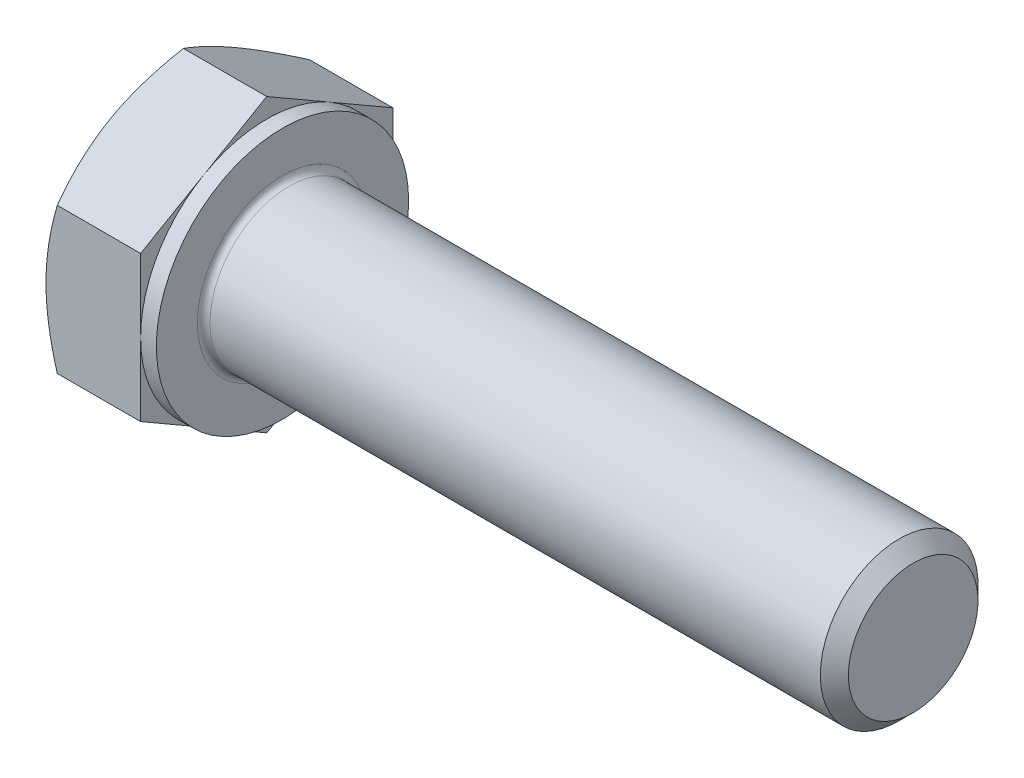
ISO-10303-21;
HEADER;
FILE_DESCRIPTION(('STEP AP214'),'2;1');
FILE_NAME('part.step','',(''),(''),'','','');
FILE_SCHEMA(('AUTOMOTIVE_DESIGN { 1 0 10303 214 1 1 1 1 }'));
ENDSEC;
DATA;
#1=APPLICATION_CONTEXT('core data for automotive mechanical design processes');
#2=APPLICATION_PROTOCOL_DEFINITION('international standard','automotive_design',2000,#1);
#3=PRODUCT_CONTEXT('',#1,'mechanical');
#4=PRODUCT('Part','Part','',(#3));
#5=PRODUCT_RELATED_PRODUCT_CATEGORY('part','',(#4));
#6=PRODUCT_DEFINITION_FORMATION('','',#4);
#7=PRODUCT_DEFINITION_CONTEXT('part definition',#1,'design');
#8=PRODUCT_DEFINITION('design','',#6,#7);
#9=PRODUCT_DEFINITION_SHAPE('','',#8);
#10=(LENGTH_UNIT() NAMED_UNIT(*) SI_UNIT(.MILLI.,.METRE.));
#11=(NAMED_UNIT(*) PLANE_ANGLE_UNIT() SI_UNIT($,.RADIAN.));
#12=(NAMED_UNIT(*) SI_UNIT($,.STERADIAN.) SOLID_ANGLE_UNIT());
#13=UNCERTAINTY_MEASURE_WITH_UNIT(LENGTH_MEASURE(1.E-05),#10,'distance_accuracy_value','');
#14=(GEOMETRIC_REPRESENTATION_CONTEXT(3) GLOBAL_UNCERTAINTY_ASSIGNED_CONTEXT((#13)) GLOBAL_UNIT_ASSIGNED_CONTEXT((#10,
#11,#12)) REPRESENTATION_CONTEXT('',''));
#15=CARTESIAN_POINT('',(0.,0.,0.));
#16=DIRECTION('',(0.,0.,1.));
#17=DIRECTION('',(1.,0.,0.));
#18=AXIS2_PLACEMENT_3D('',#15,#16,#17);
#19=CARTESIAN_POINT('',(3.5,4.61880215351701,0.));
#20=DIRECTION('',(1.,0.,0.));
#21=DIRECTION('',(0.,0.,-1.));
#22=AXIS2_PLACEMENT_3D('',#19,#20,#21);
#23=PLANE('',#22);
#24=CARTESIAN_POINT('',(3.5,0.,0.));
#25=DIRECTION('',(1.,0.,0.));
#26=DIRECTION('',(0.,0.,-1.));
#27=AXIS2_PLACEMENT_3D('',#24,#25,#26);
#28=CIRCLE('',#27,2.7);
#29=CARTESIAN_POINT('',(3.5,0.,-2.7));
#30=VERTEX_POINT('',#29);
#31=EDGE_CURVE('E44',#30,#30,#28,.F.);
#32=ORIENTED_EDGE('',*,*,#31,.T.);
#33=EDGE_LOOP('',(#32));
#34=FACE_BOUND('',#33,.T.);
#35=CARTESIAN_POINT('',(3.5,0.,0.));
#36=DIRECTION('',(1.,0.,0.));
#37=DIRECTION('',(0.,0.,-1.));
#38=AXIS2_PLACEMENT_3D('',#35,#36,#37);
#39=CIRCLE('',#38,4.);
#40=CARTESIAN_POINT('',(3.5,0.,-4.));
#41=VERTEX_POINT('',#40);
#42=EDGE_CURVE('E295',#41,#41,#39,.T.);
#43=ORIENTED_EDGE('',*,*,#42,.T.);
#44=EDGE_LOOP('',(#43));
#45=FACE_BOUND('',#44,.T.);
#46=ADVANCED_FACE('F36',(#34,#45),#23,.T.);
#47=CARTESIAN_POINT('',(0.,0.,0.));
#48=DIRECTION('',(-1.,0.,0.));
#49=DIRECTION('',(0.,0.,1.));
#50=AXIS2_PLACEMENT_3D('',#47,#48,#49);
#51=CYLINDRICAL_SURFACE('',#50,2.5);
#52=CARTESIAN_POINT('',(3.7,0.,0.));
#53=DIRECTION('',(1.,0.,0.));
#54=DIRECTION('',(0.,0.,-1.));
#55=AXIS2_PLACEMENT_3D('',#52,#53,#54);
#56=CIRCLE('',#55,2.5);
#57=CARTESIAN_POINT('',(3.7,0.,-2.5));
#58=VERTEX_POINT('',#57);
#59=EDGE_CURVE('E11',#58,#58,#56,.T.);
#60=ORIENTED_EDGE('',*,*,#59,.T.);
#61=EDGE_LOOP('',(#60));
#62=FACE_BOUND('',#61,.T.);
#63=CARTESIAN_POINT('',(23.055,0.,0.));
#64=DIRECTION('',(-1.,0.,0.));
#65=DIRECTION('',(0.,0.,1.));
#66=AXIS2_PLACEMENT_3D('',#63,#64,#65);
#67=CIRCLE('',#66,2.5);
#68=CARTESIAN_POINT('',(23.055,0.,2.5));
#69=VERTEX_POINT('',#68);
#70=EDGE_CURVE('E274',#69,#69,#67,.T.);
#71=ORIENTED_EDGE('',*,*,#70,.T.);
#72=EDGE_LOOP('',(#71));
#73=FACE_BOUND('',#72,.T.);
#74=ADVANCED_FACE('F248',(#62,#73),#51,.T.);
#75=CARTESIAN_POINT('',(23.5,0.,0.));
#76=DIRECTION('',(-1.,0.,0.));
#77=DIRECTION('',(0.,0.,1.));
#78=AXIS2_PLACEMENT_3D('',#75,#76,#77);
#79=CONICAL_SURFACE('',#78,2.055,0.785398163397439);
#80=ORIENTED_EDGE('',*,*,#70,.F.);
#81=EDGE_LOOP('',(#80));
#82=FACE_BOUND('',#81,.T.);
#83=CARTESIAN_POINT('',(23.5,0.,0.));
#84=DIRECTION('',(-1.,0.,0.));
#85=DIRECTION('',(0.,0.,1.));
#86=AXIS2_PLACEMENT_3D('',#83,#84,#85);
#87=CIRCLE('',#86,2.055);
#88=CARTESIAN_POINT('',(23.5,0.,2.055));
#89=VERTEX_POINT('',#88);
#90=EDGE_CURVE('E272',#89,#89,#87,.T.);
#91=ORIENTED_EDGE('',*,*,#90,.T.);
#92=EDGE_LOOP('',(#91));
#93=FACE_BOUND('',#92,.T.);
#94=ADVANCED_FACE('F253',(#82,#93),#79,.T.);
#95=CARTESIAN_POINT('',(23.5,0.,0.));
#96=DIRECTION('',(-1.,0.,0.));
#97=DIRECTION('',(0.,0.,1.));
#98=AXIS2_PLACEMENT_3D('',#95,#96,#97);
#99=PLANE('',#98);
#100=ORIENTED_EDGE('',*,*,#90,.F.);
#101=EDGE_LOOP('',(#100));
#102=FACE_BOUND('',#101,.T.);
#103=ADVANCED_FACE('F260',(#102),#99,.F.);
#104=CARTESIAN_POINT('',(3.,4.,0.));
#105=DIRECTION('',(1.,0.,0.));
#106=DIRECTION('',(0.,0.,-1.));
#107=AXIS2_PLACEMENT_3D('',#104,#105,#106);
#108=PLANE('',#107);
#109=DIRECTION('',(0.,0.500000000000001,0.866025403784438));
#110=VECTOR('',#109,1.);
#111=CARTESIAN_POINT('',(3.,2.3094010767585,-4.));
#112=LINE('',#111,#110);
#113=CARTESIAN_POINT('',(3.,2.3094010767585,-4.));
#114=VERTEX_POINT('',#113);
#115=CARTESIAN_POINT('',(3.,3.46410161513775,-2.));
#116=VERTEX_POINT('',#115);
#117=EDGE_CURVE('E168',#114,#116,#112,.T.);
#118=ORIENTED_EDGE('',*,*,#117,.T.);
#119=CARTESIAN_POINT('',(3.,0.,0.));
#120=DIRECTION('',(-1.,0.,0.));
#121=DIRECTION('',(0.,0.,1.));
#122=AXIS2_PLACEMENT_3D('',#119,#120,#121);
#123=CIRCLE('',#122,4.);
#124=CARTESIAN_POINT('',(3.,0.,-4.));
#125=VERTEX_POINT('',#124);
#126=EDGE_CURVE('E51',#116,#125,#123,.T.);
#127=ORIENTED_EDGE('',*,*,#126,.T.);
#128=DIRECTION('',(0.,1.,0.));
#129=VECTOR('',#128,1.);
#130=CARTESIAN_POINT('',(3.,2.3094010767585,-4.));
#131=LINE('',#130,#129);
#132=EDGE_CURVE('E298',#125,#114,#131,.T.);
#133=ORIENTED_EDGE('',*,*,#132,.T.);
#134=EDGE_LOOP('',(#118,#127,#133));
#135=FACE_BOUND('',#134,.T.);
#136=ADVANCED_FACE('F263',(#135),#108,.T.);
#137=CARTESIAN_POINT('',(3.,4.61880215351701,0.));
#138=VERTEX_POINT('',#137);
#139=EDGE_CURVE('E166',#116,#138,#112,.T.);
#140=ORIENTED_EDGE('',*,*,#139,.T.);
#141=DIRECTION('',(0.,-0.500000000000001,0.866025403784438));
#142=VECTOR('',#141,1.);
#143=CARTESIAN_POINT('',(3.,4.61880215351701,0.));
#144=LINE('',#143,#142);
#145=CARTESIAN_POINT('',(3.,3.46410161513775,2.));
#146=VERTEX_POINT('',#145);
#147=EDGE_CURVE('E165',#138,#146,#144,.T.);
#148=ORIENTED_EDGE('',*,*,#147,.T.);
#149=EDGE_CURVE('E154',#146,#116,#123,.T.);
#150=ORIENTED_EDGE('',*,*,#149,.T.);
#151=EDGE_LOOP('',(#140,#148,#150));
#152=FACE_BOUND('',#151,.T.);
#153=ADVANCED_FACE('F268',(#152),#108,.T.);
#154=CARTESIAN_POINT('',(3.,2.3094010767585,4.));
#155=VERTEX_POINT('',#154);
#156=EDGE_CURVE('E133',#146,#155,#144,.T.);
#157=ORIENTED_EDGE('',*,*,#156,.T.);
#158=DIRECTION('',(0.,-1.,0.));
#159=VECTOR('',#158,1.);
#160=CARTESIAN_POINT('',(3.,2.3094010767585,4.));
#161=LINE('',#160,#159);
#162=CARTESIAN_POINT('',(3.,0.,4.));
#163=VERTEX_POINT('',#162);
#164=EDGE_CURVE('E127',#155,#163,#161,.T.);
#165=ORIENTED_EDGE('',*,*,#164,.T.);
#166=EDGE_CURVE('E131',#163,#146,#123,.T.);
#167=ORIENTED_EDGE('',*,*,#166,.T.);
#168=EDGE_LOOP('',(#157,#165,#167));
#169=FACE_BOUND('',#168,.T.);
#170=ADVANCED_FACE('F129',(#169),#108,.T.);
#171=CARTESIAN_POINT('',(3.,-2.3094010767585,4.));
#172=VERTEX_POINT('',#171);
#173=EDGE_CURVE('E137',#163,#172,#161,.T.);
#174=ORIENTED_EDGE('',*,*,#173,.T.);
#175=DIRECTION('',(0.,-0.500000000000001,-0.866025403784438));
#176=VECTOR('',#175,1.);
#177=CARTESIAN_POINT('',(3.,-4.61880215351701,0.));
#178=LINE('',#177,#176);
#179=CARTESIAN_POINT('',(3.,-3.46410161513775,2.));
#180=VERTEX_POINT('',#179);
#181=EDGE_CURVE('E144',#172,#180,#178,.T.);
#182=ORIENTED_EDGE('',*,*,#181,.T.);
#183=EDGE_CURVE('E141',#180,#163,#123,.T.);
#184=ORIENTED_EDGE('',*,*,#183,.T.);
#185=EDGE_LOOP('',(#174,#182,#184));
#186=FACE_BOUND('',#185,.T.);
#187=ADVANCED_FACE('F142',(#186),#108,.T.);
#188=CARTESIAN_POINT('',(3.,-4.61880215351701,0.));
#189=VERTEX_POINT('',#188);
#190=EDGE_CURVE('E160',#180,#189,#178,.T.);
#191=ORIENTED_EDGE('',*,*,#190,.T.);
#192=DIRECTION('',(0.,0.5,-0.866025403784438));
#193=VECTOR('',#192,1.);
#194=CARTESIAN_POINT('',(3.,-2.30940107675851,-4.));
#195=LINE('',#194,#193);
#196=CARTESIAN_POINT('',(3.,-3.46410161513775,-2.));
#197=VERTEX_POINT('',#196);
#198=EDGE_CURVE('E336',#189,#197,#195,.T.);
#199=ORIENTED_EDGE('',*,*,#198,.T.);
#200=EDGE_CURVE('E148',#197,#180,#123,.T.);
#201=ORIENTED_EDGE('',*,*,#200,.T.);
#202=EDGE_LOOP('',(#191,#199,#201));
#203=FACE_BOUND('',#202,.T.);
#204=ADVANCED_FACE('F337',(#203),#108,.T.);
#205=CARTESIAN_POINT('',(3.,-2.30940107675851,-4.));
#206=VERTEX_POINT('',#205);
#207=EDGE_CURVE('E155',#197,#206,#195,.T.);
#208=ORIENTED_EDGE('',*,*,#207,.T.);
#209=EDGE_CURVE('E299',#206,#125,#131,.T.);
#210=ORIENTED_EDGE('',*,*,#209,.T.);
#211=EDGE_CURVE('E306',#125,#197,#123,.T.);
#212=ORIENTED_EDGE('',*,*,#211,.T.);
#213=EDGE_LOOP('',(#208,#210,#212));
#214=FACE_BOUND('',#213,.T.);
#215=ADVANCED_FACE('F269',(#214),#108,.T.);
#216=CARTESIAN_POINT('',(0.,0.,0.));
#217=DIRECTION('',(-1.,0.,0.));
#218=DIRECTION('',(0.,0.,1.));
#219=AXIS2_PLACEMENT_3D('',#216,#217,#218);
#220=CYLINDRICAL_SURFACE('',#219,4.);
#221=ORIENTED_EDGE('',*,*,#126,.F.);
#222=ORIENTED_EDGE('',*,*,#149,.F.);
#223=ORIENTED_EDGE('',*,*,#166,.F.);
#224=ORIENTED_EDGE('',*,*,#183,.F.);
#225=ORIENTED_EDGE('',*,*,#200,.F.);
#226=ORIENTED_EDGE('',*,*,#211,.F.);
#227=EDGE_LOOP('',(#221,#222,#223,#224,#225,#226));
#228=FACE_BOUND('',#227,.T.);
#229=ORIENTED_EDGE('',*,*,#42,.F.);
#230=EDGE_LOOP('',(#229));
#231=FACE_BOUND('',#230,.T.);
#232=ADVANCED_FACE('F151',(#228,#231),#220,.T.);
#233=CARTESIAN_POINT('',(0.,4.61880215351701,0.));
#234=DIRECTION('',(1.,0.,0.));
#235=DIRECTION('',(0.,0.,-1.));
#236=AXIS2_PLACEMENT_3D('',#233,#234,#235);
#237=PLANE('',#236);
#238=CARTESIAN_POINT('',(0.,0.,0.));
#239=DIRECTION('',(1.,0.,0.));
#240=DIRECTION('',(0.,0.,-1.));
#241=AXIS2_PLACEMENT_3D('',#238,#239,#240);
#242=CIRCLE('',#241,4.);
#243=CARTESIAN_POINT('',(0.,0.,-4.));
#244=VERTEX_POINT('',#243);
#245=CARTESIAN_POINT('',(0.,3.46410161513775,-2.));
#246=VERTEX_POINT('',#245);
#247=EDGE_CURVE('E294',#244,#246,#242,.T.);
#248=ORIENTED_EDGE('',*,*,#247,.F.);
#249=CARTESIAN_POINT('',(0.,-3.46410161513775,-2.));
#250=VERTEX_POINT('',#249);
#251=EDGE_CURVE('E290',#250,#244,#242,.T.);
#252=ORIENTED_EDGE('',*,*,#251,.F.);
#253=CARTESIAN_POINT('',(0.,-3.46410161513775,2.));
#254=VERTEX_POINT('',#253);
#255=EDGE_CURVE('E293',#254,#250,#242,.T.);
#256=ORIENTED_EDGE('',*,*,#255,.F.);
#257=CARTESIAN_POINT('',(0.,0.,4.));
#258=VERTEX_POINT('',#257);
#259=EDGE_CURVE('E329',#258,#254,#242,.T.);
#260=ORIENTED_EDGE('',*,*,#259,.F.);
#261=CARTESIAN_POINT('',(0.,0.,0.));
#262=DIRECTION('',(-1.,0.,0.));
#263=DIRECTION('',(0.,0.,1.));
#264=AXIS2_PLACEMENT_3D('',#261,#262,#263);
#265=CIRCLE('',#264,4.);
#266=CARTESIAN_POINT('',(0.,3.46410161513775,2.));
#267=VERTEX_POINT('',#266);
#268=EDGE_CURVE('E169',#258,#267,#265,.T.);
#269=ORIENTED_EDGE('',*,*,#268,.T.);
#270=EDGE_CURVE('E352',#246,#267,#242,.T.);
#271=ORIENTED_EDGE('',*,*,#270,.F.);
#272=EDGE_LOOP('',(#248,#252,#256,#260,#269,#271));
#273=FACE_BOUND('',#272,.T.);
#274=ADVANCED_FACE('F198',(#273),#237,.F.);
#275=CARTESIAN_POINT('',(0.,0.,0.));
#276=DIRECTION('',(1.,0.,0.));
#277=DIRECTION('',(0.,0.,-1.));
#278=AXIS2_PLACEMENT_3D('',#275,#276,#277);
#279=CONICAL_SURFACE('',#278,4.,1.0471975511966);
#280=CARTESIAN_POINT('',(0.357332259074765,2.30928560670466,4.0002));
#281=CARTESIAN_POINT('',(0.29871787364828,2.4107717464617,3.82442084967677));
#282=CARTESIAN_POINT('',(0.245410321462261,2.51313390883499,3.64712438367362));
#283=CARTESIAN_POINT('',(0.152361670746402,2.71963072479811,3.28946140682429));
#284=CARTESIAN_POINT('',(0.112653489029703,2.82376904741904,3.10908854102985));
#285=CARTESIAN_POINT('',(0.0508422152802781,3.03075510011795,2.75057818129721));
#286=CARTESIAN_POINT('',(0.0283277315228882,3.13357098372492,2.57249584706486));
#287=CARTESIAN_POINT('',(0.00145062314658159,3.33968651028528,2.21549328283349));
#288=CARTESIAN_POINT('',(-0.00293425857305684,3.44298540411434,2.0365743503559));
#289=CARTESIAN_POINT('',(0.00619007293997045,3.63600352522932,1.70225715780327));
#290=CARTESIAN_POINT('',(0.0174589539879946,3.72575165335065,1.54680884001293));
#291=CARTESIAN_POINT('',(0.0531739907981935,3.90466320392054,1.23692494436494));
#292=CARTESIAN_POINT('',(0.0776323457115334,3.99382600759479,1.08249043825587));
#293=CARTESIAN_POINT('',(0.13877606491929,4.17310641015197,0.771967672225422));
#294=CARTESIAN_POINT('',(0.175720603654864,4.26320131938131,0.615918711936898));
#295=CARTESIAN_POINT('',(0.259570072548028,4.44204742827551,0.306148164596161));
#296=CARTESIAN_POINT('',(0.306455302212741,4.53080091904967,0.152422609226221));
#297=CARTESIAN_POINT('',(0.357332259074768,4.61891762357085,-0.000199999999999949));
#298=B_SPLINE_CURVE_WITH_KNOTS('',3,(#280,#281,#282,#283,#284,#285,#286,#287,#288,#289,#290,
#291,#292,#293,#294,#295,#296,#297),.UNSPECIFIED.,.F.,.F.,(4,2,2,2,2,2,2,2,4),(0.,
0.634047835695966,1.26961969224543,1.88946157213122,2.50854226669297,3.04757825393386,
3.58711366126903,4.13861653143764,4.68903648037743),.UNSPECIFIED.);
#299=CARTESIAN_POINT('',(0.357265589908164,4.61880215351701,0.));
#300=VERTEX_POINT('',#299);
#301=EDGE_CURVE('E217',#267,#300,#298,.T.);
#302=ORIENTED_EDGE('',*,*,#301,.T.);
#303=CARTESIAN_POINT('',(0.357332259074767,4.61891762357085,0.000200000000000014));
#304=CARTESIAN_POINT('',(0.298717873648283,4.51743148381381,-0.175579150323228));
#305=CARTESIAN_POINT('',(0.245410321462263,4.41506932144052,-0.352875616326381));
#306=CARTESIAN_POINT('',(0.152361670746404,4.2085725054774,-0.710538593175706));
#307=CARTESIAN_POINT('',(0.112653489029704,4.10443418285647,-0.89091145897015));
#308=CARTESIAN_POINT('',(0.0508422152802789,3.89744813015756,-1.24942181870279));
#309=CARTESIAN_POINT('',(0.0283277315228886,3.79463224655059,-1.42750415293514));
#310=CARTESIAN_POINT('',(0.00145062314658167,3.58851671999023,-1.78450671716651));
#311=CARTESIAN_POINT('',(-0.00293425857305672,3.48521782616117,-1.9634256496441));
#312=CARTESIAN_POINT('',(0.00619007293996976,3.29219970504619,-2.29774284219673));
#313=CARTESIAN_POINT('',(0.0174589539879931,3.20245157692486,-2.45319115998706));
#314=CARTESIAN_POINT('',(0.0531739907981914,3.02354002635497,-2.76307505563505));
#315=CARTESIAN_POINT('',(0.0776323457115314,2.93437722268072,-2.91750956174413));
#316=CARTESIAN_POINT('',(0.138776064919287,2.75509682012354,-3.22803232777458));
#317=CARTESIAN_POINT('',(0.175720603654861,2.6650019108942,-3.3840812880631));
#318=CARTESIAN_POINT('',(0.259570072548024,2.486155802,-3.69385183540384));
#319=CARTESIAN_POINT('',(0.306455302212737,2.39740231122584,-3.84757739077378));
#320=CARTESIAN_POINT('',(0.357332259074764,2.30928560670466,-4.0002));
#321=B_SPLINE_CURVE_WITH_KNOTS('',3,(#303,#304,#305,#306,#307,#308,#309,#310,#311,#312,#313,
#314,#315,#316,#317,#318,#319,#320),.UNSPECIFIED.,.F.,.F.,(4,2,2,2,2,2,2,2,4),(0.,
0.634047835695966,1.26961969224543,1.88946157213122,2.50854226669297,3.04757825393386,
3.58711366126904,4.13861653143764,4.68903648037743),.UNSPECIFIED.);
#322=EDGE_CURVE('E59',#300,#246,#321,.T.);
#323=ORIENTED_EDGE('',*,*,#322,.T.);
#324=ORIENTED_EDGE('',*,*,#270,.T.);
#325=EDGE_LOOP('',(#302,#323,#324));
#326=FACE_BOUND('',#325,.T.);
#327=ADVANCED_FACE('F353',(#326),#279,.T.);
#328=CARTESIAN_POINT('',(2.00011120589743,-6.30203842761113,4.));
#329=CARTESIAN_POINT('',(1.91454696498875,-6.12645846908575,4.));
#330=CARTESIAN_POINT('',(1.82977515877993,-5.95048585830456,4.));
#331=CARTESIAN_POINT('',(1.66226027831945,-5.59754684504877,4.));
#332=CARTESIAN_POINT('',(1.57951750565517,-5.42058029958678,4.));
#333=CARTESIAN_POINT('',(1.41610926315704,-5.06457985358152,4.));
#334=CARTESIAN_POINT('',(1.33545672742033,-4.88553999633137,4.));
#335=CARTESIAN_POINT('',(1.17732358085363,-4.52607013308825,4.));
#336=CARTESIAN_POINT('',(1.09984282639237,-4.34564019048468,4.));
#337=CARTESIAN_POINT('',(0.946328318347817,-3.97695712450867,4.));
#338=CARTESIAN_POINT('',(0.870432704529691,-3.78864617668021,4.));
#339=CARTESIAN_POINT('',(0.724150215973389,-3.40985798992395,4.));
#340=CARTESIAN_POINT('',(0.653763945273171,-3.21938051607555,4.));
#341=CARTESIAN_POINT('',(0.520275623504083,-2.83628177128505,4.));
#342=CARTESIAN_POINT('',(0.457159651374154,-2.64366539864628,4.));
#343=CARTESIAN_POINT('',(0.34017151755484,-2.25567134331569,4.));
#344=CARTESIAN_POINT('',(0.286296547637719,-2.0602945190957,4.));
#345=CARTESIAN_POINT('',(0.190596079795568,-1.66775019580152,4.));
#346=CARTESIAN_POINT('',(0.148703055516465,-1.47059946092579,4.));
#347=CARTESIAN_POINT('',(0.0792701945625812,-1.07374632347739,4.));
#348=CARTESIAN_POINT('',(0.0517287925825736,-0.874044201615011,4.));
#349=CARTESIAN_POINT('',(0.0135517369810979,-0.475733691865664,4.));
#350=CARTESIAN_POINT('',(0.00269106568150293,-0.277147418102511,4.));
#351=CARTESIAN_POINT('',(-0.00180277185473733,0.120241437274123,4.));
#352=CARTESIAN_POINT('',(0.00456430935448244,0.319044021953526,4.));
#353=CARTESIAN_POINT('',(0.0293199842587319,0.653649133068292,4.));
#354=CARTESIAN_POINT('',(0.0433487696608965,0.789796206499808,4.));
#355=CARTESIAN_POINT('',(0.0786650587211739,1.06115179929909,4.));
#356=CARTESIAN_POINT('',(0.0999534653997814,1.19636019976989,4.));
#357=CARTESIAN_POINT('',(0.173595113230302,1.6003610897557,4.));
#358=CARTESIAN_POINT('',(0.235713609865278,1.86739658303731,4.));
#359=CARTESIAN_POINT('',(0.344187907647021,2.26690842404957,4.));
#360=CARTESIAN_POINT('',(0.383434484333356,2.40143348571872,4.));
#361=CARTESIAN_POINT('',(0.466191102609245,2.66917849490934,4.));
#362=CARTESIAN_POINT('',(0.509701177188772,2.8023984323233,4.));
#363=CARTESIAN_POINT('',(0.600271094434184,3.0675733938392,4.));
#364=CARTESIAN_POINT('',(0.647329943862148,3.19952876030403,4.));
#365=CARTESIAN_POINT('',(0.744425096631928,3.46233234223972,4.));
#366=CARTESIAN_POINT('',(0.794461330917672,3.5931805833084,4.));
#367=CARTESIAN_POINT('',(0.933355739925494,3.9462730239221,4.));
#368=CARTESIAN_POINT('',(1.0245987610664,4.16757823857484,4.));
#369=CARTESIAN_POINT('',(1.21247228495599,4.6078984992879,4.));
#370=CARTESIAN_POINT('',(1.30910339372387,4.82691328443148,4.));
#371=CARTESIAN_POINT('',(1.50647026715798,5.26317250533755,4.));
#372=CARTESIAN_POINT('',(1.60720747010151,5.48041628821979,4.));
#373=CARTESIAN_POINT('',(1.81181128644257,5.91342831956033,4.));
#374=CARTESIAN_POINT('',(1.91567799687904,6.12919652200915,4.));
#375=CARTESIAN_POINT('',(2.12601769056008,6.55988022094133,4.));
#376=CARTESIAN_POINT('',(2.23249454580639,6.77479382248027,4.));
#377=CARTESIAN_POINT('',(2.44739203770408,7.20364803216284,4.));
#378=CARTESIAN_POINT('',(2.55581269515436,7.41758862986447,4.));
#379=CARTESIAN_POINT('',(2.88334503640577,8.05812603677696,4.));
#380=CARTESIAN_POINT('',(3.10477549508713,8.48353660654959,4.));
#381=CARTESIAN_POINT('',(3.52798949521968,9.28704830568598,4.));
#382=CARTESIAN_POINT('',(3.72935795236482,9.66536913109686,4.));
#383=CARTESIAN_POINT('',(4.13451859351916,10.4207405604373,4.));
#384=CARTESIAN_POINT('',(4.33831092861575,10.7977910832853,3.99999999999999));
#385=CARTESIAN_POINT('',(4.74699525708428,11.5496417902084,3.99999999999999));
#386=CARTESIAN_POINT('',(4.95188119417863,11.9244452714923,3.99999999999999));
#387=CARTESIAN_POINT('',(5.36302659718326,12.6732594632005,3.99999999999999));
#388=CARTESIAN_POINT('',(5.56928595205576,13.0472702345667,3.99999999999999));
#389=CARTESIAN_POINT('',(5.7760450350038,13.42100281196,3.99999999999999));
#390=B_SPLINE_CURVE_WITH_KNOTS('',3,(#328,#329,#330,#331,#332,#333,#334,#335,#336,#337,#338,
#339,#340,#341,#342,#343,#344,#345,#346,#347,#348,#349,#350,#351,#352,#353,#354,#355,#356,#357,
#358,#359,#360,#361,#362,#363,#364,#365,#366,#367,#368,#369,#370,#371,#372,#373,#374,#375,#376,
#377,#378,#379,#380,#381,#382,#383,#384,#385,#386,#387,#388,#389),.UNSPECIFIED.,.F.,.F.,(4,2,2,
2,2,2,2,2,2,2,2,2,2,2,2,2,2,2,2,2,2,2,2,2,2,2,2,2,2,2,4),(0.,0.585964080082646,1.17201473397361,
1.76109183587772,2.35014223237615,2.95916537364923,3.56825519425104,4.17615863853847,
4.78387701983944,5.3880997905644,5.99225664601462,6.58818973021547,7.1841313739751,
7.59453803053127,8.00499575598947,8.82630884150173,9.2466697389851,9.66703388938198,
10.0872808210163,10.5075180094363,11.2255416710968,11.9436462552169,12.6620045748535,
13.3803851921263,14.0999050723894,14.8194326561991,16.2581595564571,17.5438734456803,
18.8296679016496,20.1111105471136,21.3924508191106),.UNSPECIFIED.);
#391=CARTESIAN_POINT('',(0.35726558990816,2.3094010767585,4.));
#392=VERTEX_POINT('',#391);
#393=EDGE_CURVE('E229',#258,#392,#390,.T.);
#394=ORIENTED_EDGE('',*,*,#393,.T.);
#395=EDGE_CURVE('E228',#392,#267,#298,.T.);
#396=ORIENTED_EDGE('',*,*,#395,.T.);
#397=ORIENTED_EDGE('',*,*,#268,.F.);
#398=EDGE_LOOP('',(#394,#396,#397));
#399=FACE_BOUND('',#398,.T.);
#400=ADVANCED_FACE('F323',(#399),#279,.T.);
#401=CARTESIAN_POINT('',(0.357265589908162,-2.3094010767585,4.));
#402=VERTEX_POINT('',#401);
#403=EDGE_CURVE('E275',#402,#258,#390,.T.);
#404=ORIENTED_EDGE('',*,*,#403,.T.);
#405=ORIENTED_EDGE('',*,*,#259,.T.);
#406=CARTESIAN_POINT('',(0.357332259074769,-4.61891762357085,-0.000199999999999893));
#407=CARTESIAN_POINT('',(0.298717873648285,-4.51743148381381,0.175579150323228));
#408=CARTESIAN_POINT('',(0.245410321462265,-4.41506932144052,0.352875616326381));
#409=CARTESIAN_POINT('',(0.152361670746406,-4.2085725054774,0.710538593175707));
#410=CARTESIAN_POINT('',(0.112653489029706,-4.10443418285647,0.890911458970151));
#411=CARTESIAN_POINT('',(0.0508422152802807,-3.89744813015756,1.24942181870279));
#412=CARTESIAN_POINT('',(0.0283277315228903,-3.7946322465506,1.42750415293514));
#413=CARTESIAN_POINT('',(0.00145062314658299,-3.58851671999023,1.78450671716651));
#414=CARTESIAN_POINT('',(-0.00293425857305564,-3.48521782616117,1.9634256496441));
#415=CARTESIAN_POINT('',(0.00619007293997126,-3.29219970504619,2.29774284219673));
#416=CARTESIAN_POINT('',(0.0174589539879951,-3.20245157692487,2.45319115998707));
#417=CARTESIAN_POINT('',(0.0531739907981936,-3.02354002635497,2.76307505563506));
#418=CARTESIAN_POINT('',(0.0776323457115331,-2.93437722268073,2.91750956174413));
#419=CARTESIAN_POINT('',(0.138776064919289,-2.75509682012354,3.22803232777458));
#420=CARTESIAN_POINT('',(0.175720603654863,-2.6650019108942,3.3840812880631));
#421=CARTESIAN_POINT('',(0.259570072548026,-2.48615580200001,3.69385183540384));
#422=CARTESIAN_POINT('',(0.306455302212739,-2.39740231122585,3.84757739077378));
#423=CARTESIAN_POINT('',(0.357332259074765,-2.30928560670467,4.0002));
#424=B_SPLINE_CURVE_WITH_KNOTS('',3,(#406,#407,#408,#409,#410,#411,#412,#413,#414,#415,#416,
#417,#418,#419,#420,#421,#422,#423),.UNSPECIFIED.,.F.,.F.,(4,2,2,2,2,2,2,2,4),(0.,
0.634047835695967,1.26961969224544,1.88946157213122,2.50854226669297,3.04757825393386,
3.58711366126904,4.13861653143764,4.68903648037743),.UNSPECIFIED.);
#425=EDGE_CURVE('E219',#254,#402,#424,.T.);
#426=ORIENTED_EDGE('',*,*,#425,.T.);
#427=EDGE_LOOP('',(#404,#405,#426));
#428=FACE_BOUND('',#427,.T.);
#429=ADVANCED_FACE('F187',(#428),#279,.T.);
#430=CARTESIAN_POINT('',(0.357265589908165,-4.61880215351701,0.));
#431=VERTEX_POINT('',#430);
#432=EDGE_CURVE('E212',#431,#254,#424,.T.);
#433=ORIENTED_EDGE('',*,*,#432,.T.);
#434=ORIENTED_EDGE('',*,*,#255,.T.);
#435=CARTESIAN_POINT('',(0.357332259074767,-2.30928560670467,-4.0002));
#436=CARTESIAN_POINT('',(0.298717873648283,-2.41077174646171,-3.82442084967677));
#437=CARTESIAN_POINT('',(0.245410321462263,-2.513133908835,-3.64712438367362));
#438=CARTESIAN_POINT('',(0.152361670746404,-2.71963072479812,-3.28946140682429));
#439=CARTESIAN_POINT('',(0.112653489029705,-2.82376904741905,-3.10908854102985));
#440=CARTESIAN_POINT('',(0.0508422152802804,-3.03075510011796,-2.75057818129721));
#441=CARTESIAN_POINT('',(0.0283277315228907,-3.13357098372492,-2.57249584706486));
#442=CARTESIAN_POINT('',(0.00145062314658398,-3.33968651028529,-2.21549328283349));
#443=CARTESIAN_POINT('',(-0.00293425857305478,-3.44298540411435,-2.0365743503559));
#444=CARTESIAN_POINT('',(0.00619007293997239,-3.63600352522933,-1.70225715780327));
#445=CARTESIAN_POINT('',(0.0174589539879966,-3.72575165335065,-1.54680884001293));
#446=CARTESIAN_POINT('',(0.0531739907981956,-3.90466320392055,-1.23692494436494));
#447=CARTESIAN_POINT('',(0.0776323457115355,-3.99382600759479,-1.08249043825587));
#448=CARTESIAN_POINT('',(0.138776064919292,-4.17310641015198,-0.771967672225422));
#449=CARTESIAN_POINT('',(0.175720603654866,-4.26320131938132,-0.615918711936898));
#450=CARTESIAN_POINT('',(0.25957007254803,-4.44204742827551,-0.30614816459616));
#451=CARTESIAN_POINT('',(0.306455302212743,-4.53080091904967,-0.15242260922622));
#452=CARTESIAN_POINT('',(0.357332259074769,-4.61891762357085,0.000200000000000426));
#453=B_SPLINE_CURVE_WITH_KNOTS('',3,(#435,#436,#437,#438,#439,#440,#441,#442,#443,#444,#445,
#446,#447,#448,#449,#450,#451,#452),.UNSPECIFIED.,.F.,.F.,(4,2,2,2,2,2,2,2,4),(0.,
0.634047835695966,1.26961969224543,1.88946157213122,2.50854226669297,3.04757825393386,
3.58711366126903,4.13861653143764,4.68903648037743),.UNSPECIFIED.);
#454=EDGE_CURVE('E218',#250,#431,#453,.T.);
#455=ORIENTED_EDGE('',*,*,#454,.T.);
#456=EDGE_LOOP('',(#433,#434,#455));
#457=FACE_BOUND('',#456,.T.);
#458=ADVANCED_FACE('F351',(#457),#279,.T.);
#459=CARTESIAN_POINT('',(0.35726558990816,2.3094010767585,-4.));
#460=VERTEX_POINT('',#459);
#461=EDGE_CURVE('E220',#246,#460,#321,.T.);
#462=ORIENTED_EDGE('',*,*,#461,.T.);
#463=CARTESIAN_POINT('',(2.00011120385047,-6.30203842341183,-4.));
#464=CARTESIAN_POINT('',(1.91454696302707,-6.12645846502785,-4.));
#465=CARTESIAN_POINT('',(1.82977515690347,-5.95048585438817,-4.));
#466=CARTESIAN_POINT('',(1.66226027661304,-5.59754684141582,-4.));
#467=CARTESIAN_POINT('',(1.57951750403358,-5.42058029609576,-4.));
#468=CARTESIAN_POINT('',(1.41610926170511,-5.06457985037649,-4.));
#469=CARTESIAN_POINT('',(1.33545672605324,-4.8855399932704,-4.));
#470=CARTESIAN_POINT('',(1.17732357965483,-4.52607013031638,-4.));
#471=CARTESIAN_POINT('',(1.09984282527702,-4.34564018785784,-4.));
#472=CARTESIAN_POINT('',(0.946328317401941,-3.97695712218343,-4.));
#473=CARTESIAN_POINT('',(0.870432703669647,-3.78864617451164,-4.));
#474=CARTESIAN_POINT('',(0.724150215280474,-3.40985798807121,-4.));
#475=CARTESIAN_POINT('',(0.653763944661552,-3.21938051438197,-4.));
#476=CARTESIAN_POINT('',(0.520275623047372,-2.83628176991274,-4.));
#477=CARTESIAN_POINT('',(0.457159650991077,-2.64366539743606,-4.));
#478=CARTESIAN_POINT('',(0.340171517307159,-2.25567134243403,-4.));
#479=CARTESIAN_POINT('',(0.286296547451807,-2.06029451838052,-4.));
#480=CARTESIAN_POINT('',(0.190596079734459,-1.66775019550379,-4.));
#481=CARTESIAN_POINT('',(0.148703055513724,-1.4705994608802,-4.));
#482=CARTESIAN_POINT('',(0.0792701946386928,-1.07374632394227,-4.));
#483=CARTESIAN_POINT('',(0.051728792679198,-0.874044202338206,-4.));
#484=CARTESIAN_POINT('',(0.013551737072628,-0.475733693101286,-4.));
#485=CARTESIAN_POINT('',(0.00269106574828971,-0.277147419592185,-4.));
#486=CARTESIAN_POINT('',(-0.00180277188208268,0.120241435280096,-4.));
#487=CARTESIAN_POINT('',(0.00456430925773773,0.3190440197092,-4.));
#488=CARTESIAN_POINT('',(0.0293199840216137,0.653649130511194,-4.));
#489=CARTESIAN_POINT('',(0.0433487693682718,0.789796203877394,-4.));
#490=CARTESIAN_POINT('',(0.0786650583146091,1.06115179654901,-4.));
#491=CARTESIAN_POINT('',(0.0999534649347825,1.19636019695746,-4.));
#492=CARTESIAN_POINT('',(0.173595112588807,1.6003610867597,-4.));
#493=CARTESIAN_POINT('',(0.2357136091046,1.86739657992385,-4.));
#494=CARTESIAN_POINT('',(0.344187906710574,2.26690842076044,-4.));
#495=CARTESIAN_POINT('',(0.383434483337919,2.40143348236974,-4.));
#496=CARTESIAN_POINT('',(0.466191101497675,2.66917849144137,-4.));
#497=CARTESIAN_POINT('',(0.50970117602006,2.80239842879618,-4.));
#498=CARTESIAN_POINT('',(0.600271093153281,3.06757339019424,-4.));
#499=CARTESIAN_POINT('',(0.647329942526199,3.19952875660037,-4.));
#500=CARTESIAN_POINT('',(0.744425095187847,3.46233233841866,-4.));
#501=CARTESIAN_POINT('',(0.794461329420505,3.59318057942864,-4.));
#502=CARTESIAN_POINT('',(0.933355738336682,3.9462730200095,-4.));
#503=CARTESIAN_POINT('',(1.02459875944487,4.16757823468633,-4.));
#504=CARTESIAN_POINT('',(1.21247228327857,4.60789849544446,-4.));
#505=CARTESIAN_POINT('',(1.30910339202327,4.82691328060901,-4.));
#506=CARTESIAN_POINT('',(1.50647026541792,5.26317250155476,-4.));
#507=CARTESIAN_POINT('',(1.60720746834516,5.48041628445571,-4.));
#508=CARTESIAN_POINT('',(1.81181128465854,5.91342831583169,-4.));
#509=CARTESIAN_POINT('',(1.91567799508361,6.12919651829724,-4.));
#510=CARTESIAN_POINT('',(2.1260176887459,6.55988021726237,-4.));
#511=CARTESIAN_POINT('',(2.23249454398486,6.77479381881753,-4.));
#512=CARTESIAN_POINT('',(2.44739203587053,7.20364802853132,-4.));
#513=CARTESIAN_POINT('',(2.55581269331614,7.41758862624796,-4.));
#514=CARTESIAN_POINT('',(2.88334503455633,8.05812603320372,-4.));
#515=CARTESIAN_POINT('',(3.10477549323411,8.48353660300322,-4.));
#516=CARTESIAN_POINT('',(3.52798949335262,9.2870483021662,-4.));
#517=CARTESIAN_POINT('',(3.72935795048665,9.66536912757712,-4.));
#518=CARTESIAN_POINT('',(4.13451859162103,10.4207405569166,-4.));
#519=CARTESIAN_POINT('',(4.33831092670878,10.7977910797636,-4.));
#520=CARTESIAN_POINT('',(4.74699525515911,11.5496417866802,-4.));
#521=CARTESIAN_POINT('',(4.95188119224406,11.9244452679585,-4.));
#522=CARTESIAN_POINT('',(5.36302659523093,12.673259459655,-4.));
#523=CARTESIAN_POINT('',(5.56928595009505,13.0472702310149,-4.));
#524=CARTESIAN_POINT('',(5.77604503303505,13.4210028084018,-4.));
#525=B_SPLINE_CURVE_WITH_KNOTS('',3,(#463,#464,#465,#466,#467,#468,#469,#470,#471,#472,#473,
#474,#475,#476,#477,#478,#479,#480,#481,#482,#483,#484,#485,#486,#487,#488,#489,#490,#491,#492,
#493,#494,#495,#496,#497,#498,#499,#500,#501,#502,#503,#504,#505,#506,#507,#508,#509,#510,#511,
#512,#513,#514,#515,#516,#517,#518,#519,#520,#521,#522,#523,#524),.UNSPECIFIED.,.F.,.F.,(4,2,2,
2,2,2,2,2,2,2,2,2,2,2,2,2,2,2,2,2,2,2,2,2,2,2,2,2,2,2,4),(0.,0.585964079589228,1.1720147329867,
1.76109183439221,2.35014223039207,2.95916537113302,3.56825519120251,4.17615863495934,
4.78387701573011,5.38809978568042,5.99225664035712,6.58818972380394,7.1841313668092,
7.59453802315344,8.00499574839967,8.82630883348707,9.24666973074843,9.66703388092333,
10.0872808123363,10.5075180005348,11.2255416622244,11.9436462463738,12.6620045660407,
13.3803851833438,14.0999050636407,14.8194326474842,16.2581595478086,17.5438734370163,
18.8296678929703,20.1111105384062,21.3924508103747),.UNSPECIFIED.);
#526=EDGE_CURVE('E180',#460,#244,#525,.F.);
#527=ORIENTED_EDGE('',*,*,#526,.T.);
#528=ORIENTED_EDGE('',*,*,#247,.T.);
#529=EDGE_LOOP('',(#462,#527,#528));
#530=FACE_BOUND('',#529,.T.);
#531=ADVANCED_FACE('F348',(#530),#279,.T.);
#532=CARTESIAN_POINT('',(0.357265589908045,-2.30940107675869,-4.));
#533=VERTEX_POINT('',#532);
#534=EDGE_CURVE('E181',#533,#250,#453,.T.);
#535=ORIENTED_EDGE('',*,*,#534,.T.);
#536=ORIENTED_EDGE('',*,*,#251,.T.);
#537=EDGE_CURVE('E172',#244,#533,#525,.F.);
#538=ORIENTED_EDGE('',*,*,#537,.T.);
#539=EDGE_LOOP('',(#535,#536,#538));
#540=FACE_BOUND('',#539,.T.);
#541=ADVANCED_FACE('F196',(#540),#279,.T.);
#542=CARTESIAN_POINT('',(3.5,2.3094010767585,-4.));
#543=DIRECTION('',(0.,0.,1.));
#544=DIRECTION('',(1.,0.,0.));
#545=AXIS2_PLACEMENT_3D('',#542,#543,#544);
#546=PLANE('',#545);
#547=ORIENTED_EDGE('',*,*,#209,.F.);
#548=DIRECTION('',(-1.,0.,0.));
#549=VECTOR('',#548,1.);
#550=CARTESIAN_POINT('',(3.5,-2.30940107675851,-4.));
#551=LINE('',#550,#549);
#552=EDGE_CURVE('E281',#206,#533,#551,.T.);
#553=ORIENTED_EDGE('',*,*,#552,.T.);
#554=ORIENTED_EDGE('',*,*,#537,.F.);
#555=ORIENTED_EDGE('',*,*,#526,.F.);
#556=DIRECTION('',(-1.,0.,0.));
#557=VECTOR('',#556,1.);
#558=CARTESIAN_POINT('',(3.5,2.3094010767585,-4.));
#559=LINE('',#558,#557);
#560=EDGE_CURVE('E277',#114,#460,#559,.T.);
#561=ORIENTED_EDGE('',*,*,#560,.F.);
#562=ORIENTED_EDGE('',*,*,#132,.F.);
#563=EDGE_LOOP('',(#547,#553,#554,#555,#561,#562));
#564=FACE_BOUND('',#563,.T.);
#565=ADVANCED_FACE('F191',(#564),#546,.F.);
#566=CARTESIAN_POINT('',(3.5,-2.30940107675851,-4.));
#567=DIRECTION('',(0.,0.866025403784438,0.5));
#568=DIRECTION('',(0.,-0.5,0.866025403784438));
#569=AXIS2_PLACEMENT_3D('',#566,#567,#568);
#570=PLANE('',#569);
#571=ORIENTED_EDGE('',*,*,#198,.F.);
#572=DIRECTION('',(-1.,0.,0.));
#573=VECTOR('',#572,1.);
#574=CARTESIAN_POINT('',(3.5,-4.61880215351701,0.));
#575=LINE('',#574,#573);
#576=EDGE_CURVE('E283',#189,#431,#575,.T.);
#577=ORIENTED_EDGE('',*,*,#576,.T.);
#578=ORIENTED_EDGE('',*,*,#454,.F.);
#579=ORIENTED_EDGE('',*,*,#534,.F.);
#580=ORIENTED_EDGE('',*,*,#552,.F.);
#581=ORIENTED_EDGE('',*,*,#207,.F.);
#582=EDGE_LOOP('',(#571,#577,#578,#579,#580,#581));
#583=FACE_BOUND('',#582,.T.);
#584=ADVANCED_FACE('F195',(#583),#570,.F.);
#585=CARTESIAN_POINT('',(3.5,-4.61880215351701,0.));
#586=DIRECTION('',(0.,0.866025403784438,-0.500000000000001));
#587=DIRECTION('',(0.,0.500000000000001,0.866025403784438));
#588=AXIS2_PLACEMENT_3D('',#585,#586,#587);
#589=PLANE('',#588);
#590=ORIENTED_EDGE('',*,*,#181,.F.);
#591=DIRECTION('',(-1.,0.,0.));
#592=VECTOR('',#591,1.);
#593=CARTESIAN_POINT('',(3.5,-2.3094010767585,4.));
#594=LINE('',#593,#592);
#595=EDGE_CURVE('E159',#172,#402,#594,.T.);
#596=ORIENTED_EDGE('',*,*,#595,.T.);
#597=ORIENTED_EDGE('',*,*,#425,.F.);
#598=ORIENTED_EDGE('',*,*,#432,.F.);
#599=ORIENTED_EDGE('',*,*,#576,.F.);
#600=ORIENTED_EDGE('',*,*,#190,.F.);
#601=EDGE_LOOP('',(#590,#596,#597,#598,#599,#600));
#602=FACE_BOUND('',#601,.T.);
#603=ADVANCED_FACE('F203',(#602),#589,.F.);
#604=CARTESIAN_POINT('',(3.5,2.3094010767585,4.));
#605=DIRECTION('',(0.,0.,-1.));
#606=DIRECTION('',(0.,1.,0.));
#607=AXIS2_PLACEMENT_3D('',#604,#605,#606);
#608=PLANE('',#607);
#609=ORIENTED_EDGE('',*,*,#164,.F.);
#610=DIRECTION('',(-1.,0.,0.));
#611=VECTOR('',#610,1.);
#612=CARTESIAN_POINT('',(3.5,2.3094010767585,4.));
#613=LINE('',#612,#611);
#614=EDGE_CURVE('E286',#155,#392,#613,.T.);
#615=ORIENTED_EDGE('',*,*,#614,.T.);
#616=ORIENTED_EDGE('',*,*,#393,.F.);
#617=ORIENTED_EDGE('',*,*,#403,.F.);
#618=ORIENTED_EDGE('',*,*,#595,.F.);
#619=ORIENTED_EDGE('',*,*,#173,.F.);
#620=EDGE_LOOP('',(#609,#615,#616,#617,#618,#619));
#621=FACE_BOUND('',#620,.T.);
#622=ADVANCED_FACE('F157',(#621),#608,.F.);
#623=CARTESIAN_POINT('',(3.5,4.61880215351701,0.));
#624=DIRECTION('',(0.,-0.866025403784438,-0.500000000000001));
#625=DIRECTION('',(0.,0.500000000000001,-0.866025403784438));
#626=AXIS2_PLACEMENT_3D('',#623,#624,#625);
#627=PLANE('',#626);
#628=ORIENTED_EDGE('',*,*,#147,.F.);
#629=DIRECTION('',(-1.,0.,0.));
#630=VECTOR('',#629,1.);
#631=CARTESIAN_POINT('',(3.5,4.61880215351701,0.));
#632=LINE('',#631,#630);
#633=EDGE_CURVE('E288',#138,#300,#632,.T.);
#634=ORIENTED_EDGE('',*,*,#633,.T.);
#635=ORIENTED_EDGE('',*,*,#301,.F.);
#636=ORIENTED_EDGE('',*,*,#395,.F.);
#637=ORIENTED_EDGE('',*,*,#614,.F.);
#638=ORIENTED_EDGE('',*,*,#156,.F.);
#639=EDGE_LOOP('',(#628,#634,#635,#636,#637,#638));
#640=FACE_BOUND('',#639,.T.);
#641=ADVANCED_FACE('F234',(#640),#627,.F.);
#642=CARTESIAN_POINT('',(3.5,2.3094010767585,-4.));
#643=DIRECTION('',(0.,-0.866025403784438,0.500000000000001));
#644=DIRECTION('',(0.,-0.500000000000001,-0.866025403784438));
#645=AXIS2_PLACEMENT_3D('',#642,#643,#644);
#646=PLANE('',#645);
#647=ORIENTED_EDGE('',*,*,#117,.F.);
#648=ORIENTED_EDGE('',*,*,#560,.T.);
#649=ORIENTED_EDGE('',*,*,#461,.F.);
#650=ORIENTED_EDGE('',*,*,#322,.F.);
#651=ORIENTED_EDGE('',*,*,#633,.F.);
#652=ORIENTED_EDGE('',*,*,#139,.F.);
#653=EDGE_LOOP('',(#647,#648,#649,#650,#651,#652));
#654=FACE_BOUND('',#653,.T.);
#655=ADVANCED_FACE('F237',(#654),#646,.F.);
#656=CARTESIAN_POINT('',(3.7,0.,0.));
#657=DIRECTION('',(1.,0.,0.));
#658=DIRECTION('',(0.,0.,-1.));
#659=AXIS2_PLACEMENT_3D('',#656,#657,#658);
#660=TOROIDAL_SURFACE('',#659,2.7,0.2);
#661=ORIENTED_EDGE('',*,*,#59,.F.);
#662=EDGE_LOOP('',(#661));
#663=FACE_BOUND('',#662,.T.);
#664=ORIENTED_EDGE('',*,*,#31,.F.);
#665=EDGE_LOOP('',(#664));
#666=FACE_BOUND('',#665,.T.);
#667=ADVANCED_FACE('F38',(#663,#666),#660,.F.);
#668=CLOSED_SHELL('',(#46,#74,#94,#103,#136,#153,#170,#187,#204,#215,#232,#274,#327,#400,#429,
#458,#531,#541,#565,#584,#603,#622,#641,#655,#667));
#669=MANIFOLD_SOLID_BREP('B2',#668);
#670=ADVANCED_BREP_SHAPE_REPRESENTATION('',(#18,#669),#14);
#671=SHAPE_DEFINITION_REPRESENTATION(#9,#670);
ENDSEC;
END-ISO-10303-21;
